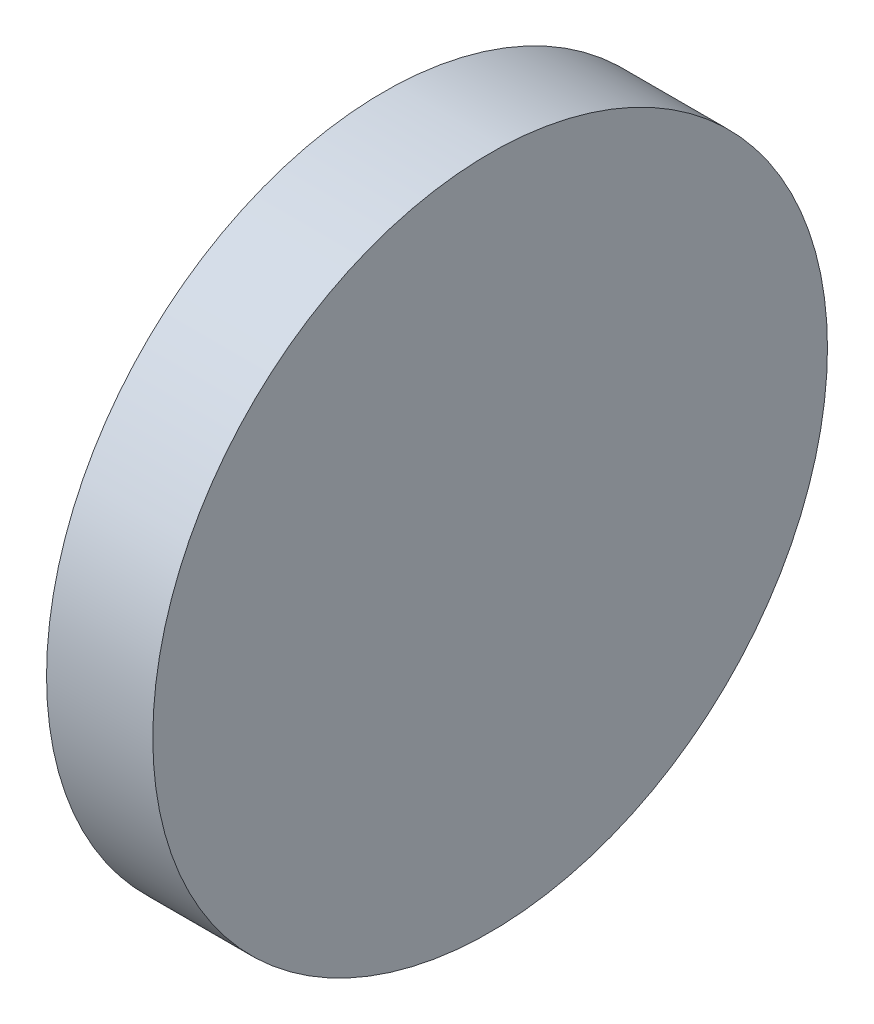
ISO-10303-21;
HEADER;
FILE_DESCRIPTION(('STEP AP214'),'2;1');
FILE_NAME('part.step','',(''),(''),'','','');
FILE_SCHEMA(('AUTOMOTIVE_DESIGN { 1 0 10303 214 1 1 1 1 }'));
ENDSEC;
DATA;
#1=APPLICATION_CONTEXT('core data for automotive mechanical design processes');
#2=APPLICATION_PROTOCOL_DEFINITION('international standard','automotive_design',2000,#1);
#3=PRODUCT_CONTEXT('',#1,'mechanical');
#4=PRODUCT('Part','Part','',(#3));
#5=PRODUCT_RELATED_PRODUCT_CATEGORY('part','',(#4));
#6=PRODUCT_DEFINITION_FORMATION('','',#4);
#7=PRODUCT_DEFINITION_CONTEXT('part definition',#1,'design');
#8=PRODUCT_DEFINITION('design','',#6,#7);
#9=PRODUCT_DEFINITION_SHAPE('','',#8);
#10=(LENGTH_UNIT() NAMED_UNIT(*) SI_UNIT(.MILLI.,.METRE.));
#11=(NAMED_UNIT(*) PLANE_ANGLE_UNIT() SI_UNIT($,.RADIAN.));
#12=(NAMED_UNIT(*) SI_UNIT($,.STERADIAN.) SOLID_ANGLE_UNIT());
#13=UNCERTAINTY_MEASURE_WITH_UNIT(LENGTH_MEASURE(1.E-05),#10,'distance_accuracy_value','');
#14=(GEOMETRIC_REPRESENTATION_CONTEXT(3) GLOBAL_UNCERTAINTY_ASSIGNED_CONTEXT((#13)) GLOBAL_UNIT_ASSIGNED_CONTEXT((#10,
#11,#12)) REPRESENTATION_CONTEXT('',''));
#15=CARTESIAN_POINT('',(0.,0.,0.));
#16=DIRECTION('',(0.,0.,1.));
#17=DIRECTION('',(1.,0.,0.));
#18=AXIS2_PLACEMENT_3D('',#15,#16,#17);
#19=CARTESIAN_POINT('',(0.,0.,0.));
#20=DIRECTION('',(-1.,0.,0.));
#21=DIRECTION('',(0.,0.,1.));
#22=AXIS2_PLACEMENT_3D('',#19,#20,#21);
#23=CYLINDRICAL_SURFACE('',#22,6.35);
#24=CARTESIAN_POINT('',(0.,0.,0.));
#25=DIRECTION('',(-1.,0.,0.));
#26=DIRECTION('',(0.,0.,1.));
#27=AXIS2_PLACEMENT_3D('',#24,#25,#26);
#28=CIRCLE('',#27,6.35);
#29=CARTESIAN_POINT('',(0.,0.,6.35));
#30=VERTEX_POINT('',#29);
#31=EDGE_CURVE('E44',#30,#30,#28,.T.);
#32=ORIENTED_EDGE('',*,*,#31,.F.);
#33=EDGE_LOOP('',(#32));
#34=FACE_BOUND('',#33,.T.);
#35=CARTESIAN_POINT('',(2.,0.,0.));
#36=DIRECTION('',(-1.,0.,0.));
#37=DIRECTION('',(0.,0.,1.));
#38=AXIS2_PLACEMENT_3D('',#35,#36,#37);
#39=CIRCLE('',#38,6.35);
#40=CARTESIAN_POINT('',(2.,0.,6.35));
#41=VERTEX_POINT('',#40);
#42=EDGE_CURVE('E10',#41,#41,#39,.T.);
#43=ORIENTED_EDGE('',*,*,#42,.T.);
#44=EDGE_LOOP('',(#43));
#45=FACE_BOUND('',#44,.T.);
#46=ADVANCED_FACE('F37',(#34,#45),#23,.T.);
#47=CARTESIAN_POINT('',(2.,6.35,0.));
#48=DIRECTION('',(-1.,0.,0.));
#49=DIRECTION('',(0.,0.,1.));
#50=AXIS2_PLACEMENT_3D('',#47,#48,#49);
#51=PLANE('',#50);
#52=ORIENTED_EDGE('',*,*,#42,.F.);
#53=EDGE_LOOP('',(#52));
#54=FACE_BOUND('',#53,.T.);
#55=ADVANCED_FACE('F54',(#54),#51,.F.);
#56=CARTESIAN_POINT('',(0.,6.35,0.));
#57=DIRECTION('',(1.,0.,0.));
#58=DIRECTION('',(0.,0.,-1.));
#59=AXIS2_PLACEMENT_3D('',#56,#57,#58);
#60=PLANE('',#59);
#61=ORIENTED_EDGE('',*,*,#31,.T.);
#62=EDGE_LOOP('',(#61));
#63=FACE_BOUND('',#62,.T.);
#64=ADVANCED_FACE('F51',(#63),#60,.F.);
#65=CLOSED_SHELL('',(#46,#55,#64));
#66=MANIFOLD_SOLID_BREP('B2',#65);
#67=ADVANCED_BREP_SHAPE_REPRESENTATION('',(#18,#66),#14);
#68=SHAPE_DEFINITION_REPRESENTATION(#9,#67);
ENDSEC;
END-ISO-10303-21;
